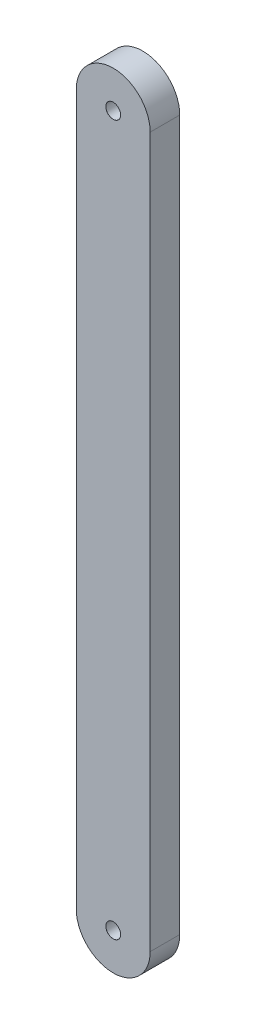
ISO-10303-21;
HEADER;
FILE_DESCRIPTION(('STEP AP214'),'2;1');
FILE_NAME('part.step','',(''),(''),'','','');
FILE_SCHEMA(('AUTOMOTIVE_DESIGN { 1 0 10303 214 1 1 1 1 }'));
ENDSEC;
DATA;
#1=APPLICATION_CONTEXT('core data for automotive mechanical design processes');
#2=APPLICATION_PROTOCOL_DEFINITION('international standard','automotive_design',2000,#1);
#3=PRODUCT_CONTEXT('',#1,'mechanical');
#4=PRODUCT('Part','Part','',(#3));
#5=PRODUCT_RELATED_PRODUCT_CATEGORY('part','',(#4));
#6=PRODUCT_DEFINITION_FORMATION('','',#4);
#7=PRODUCT_DEFINITION_CONTEXT('part definition',#1,'design');
#8=PRODUCT_DEFINITION('design','',#6,#7);
#9=PRODUCT_DEFINITION_SHAPE('','',#8);
#10=(LENGTH_UNIT() NAMED_UNIT(*) SI_UNIT(.MILLI.,.METRE.));
#11=(NAMED_UNIT(*) PLANE_ANGLE_UNIT() SI_UNIT($,.RADIAN.));
#12=(NAMED_UNIT(*) SI_UNIT($,.STERADIAN.) SOLID_ANGLE_UNIT());
#13=UNCERTAINTY_MEASURE_WITH_UNIT(LENGTH_MEASURE(1.E-05),#10,'distance_accuracy_value','');
#14=(GEOMETRIC_REPRESENTATION_CONTEXT(3) GLOBAL_UNCERTAINTY_ASSIGNED_CONTEXT((#13)) GLOBAL_UNIT_ASSIGNED_CONTEXT((#10,
#11,#12)) REPRESENTATION_CONTEXT('',''));
#15=CARTESIAN_POINT('',(0.,0.,0.));
#16=DIRECTION('',(0.,0.,1.));
#17=DIRECTION('',(1.,0.,0.));
#18=AXIS2_PLACEMENT_3D('',#15,#16,#17);
#19=CARTESIAN_POINT('',(-25.,-240.,20.));
#20=DIRECTION('',(0.,0.,-1.));
#21=DIRECTION('',(-1.,0.,0.));
#22=AXIS2_PLACEMENT_3D('',#19,#20,#21);
#23=CYLINDRICAL_SURFACE('',#22,25.);
#24=CARTESIAN_POINT('',(-25.,-240.,0.));
#25=DIRECTION('',(0.,0.,1.));
#26=DIRECTION('',(-1.,0.,0.));
#27=AXIS2_PLACEMENT_3D('',#24,#25,#26);
#28=CIRCLE('',#27,25.);
#29=CARTESIAN_POINT('',(-50.,-240.,0.));
#30=VERTEX_POINT('',#29);
#31=CARTESIAN_POINT('',(0.,-240.,0.));
#32=VERTEX_POINT('',#31);
#33=EDGE_CURVE('E96',#30,#32,#28,.T.);
#34=ORIENTED_EDGE('',*,*,#33,.T.);
#35=DIRECTION('',(0.,0.,-1.));
#36=VECTOR('',#35,1.);
#37=CARTESIAN_POINT('',(0.,-240.,20.));
#38=LINE('',#37,#36);
#39=CARTESIAN_POINT('',(0.,-240.,20.));
#40=VERTEX_POINT('',#39);
#41=EDGE_CURVE('E11',#40,#32,#38,.T.);
#42=ORIENTED_EDGE('',*,*,#41,.F.);
#43=CARTESIAN_POINT('',(-25.,-240.,20.));
#44=DIRECTION('',(0.,0.,1.));
#45=DIRECTION('',(-1.,0.,0.));
#46=AXIS2_PLACEMENT_3D('',#43,#44,#45);
#47=CIRCLE('',#46,25.);
#48=CARTESIAN_POINT('',(-50.,-240.,20.));
#49=VERTEX_POINT('',#48);
#50=EDGE_CURVE('E84',#49,#40,#47,.T.);
#51=ORIENTED_EDGE('',*,*,#50,.F.);
#52=DIRECTION('',(0.,0.,-1.));
#53=VECTOR('',#52,1.);
#54=CARTESIAN_POINT('',(-50.,-240.,20.));
#55=LINE('',#54,#53);
#56=EDGE_CURVE('E92',#49,#30,#55,.T.);
#57=ORIENTED_EDGE('',*,*,#56,.T.);
#58=EDGE_LOOP('',(#34,#42,#51,#57));
#59=FACE_BOUND('',#58,.T.);
#60=ADVANCED_FACE('F33',(#59),#23,.T.);
#61=CARTESIAN_POINT('',(0.,240.,20.));
#62=DIRECTION('',(-1.,0.,0.));
#63=DIRECTION('',(0.,-1.,0.));
#64=AXIS2_PLACEMENT_3D('',#61,#62,#63);
#65=PLANE('',#64);
#66=DIRECTION('',(0.,1.,0.));
#67=VECTOR('',#66,1.);
#68=CARTESIAN_POINT('',(0.,240.,0.));
#69=LINE('',#68,#67);
#70=CARTESIAN_POINT('',(0.,240.,0.));
#71=VERTEX_POINT('',#70);
#72=EDGE_CURVE('E88',#32,#71,#69,.T.);
#73=ORIENTED_EDGE('',*,*,#72,.T.);
#74=DIRECTION('',(0.,0.,-1.));
#75=VECTOR('',#74,1.);
#76=CARTESIAN_POINT('',(0.,240.,20.));
#77=LINE('',#76,#75);
#78=CARTESIAN_POINT('',(0.,240.,20.));
#79=VERTEX_POINT('',#78);
#80=EDGE_CURVE('E41',#79,#71,#77,.T.);
#81=ORIENTED_EDGE('',*,*,#80,.F.);
#82=DIRECTION('',(0.,1.,0.));
#83=VECTOR('',#82,1.);
#84=CARTESIAN_POINT('',(0.,240.,20.));
#85=LINE('',#84,#83);
#86=EDGE_CURVE('E79',#40,#79,#85,.T.);
#87=ORIENTED_EDGE('',*,*,#86,.F.);
#88=ORIENTED_EDGE('',*,*,#41,.T.);
#89=EDGE_LOOP('',(#73,#81,#87,#88));
#90=FACE_BOUND('',#89,.T.);
#91=ADVANCED_FACE('F87',(#90),#65,.F.);
#92=CARTESIAN_POINT('',(-25.,240.,20.));
#93=DIRECTION('',(0.,0.,-1.));
#94=DIRECTION('',(-1.,0.,0.));
#95=AXIS2_PLACEMENT_3D('',#92,#93,#94);
#96=CYLINDRICAL_SURFACE('',#95,25.);
#97=CARTESIAN_POINT('',(-25.,240.,0.));
#98=DIRECTION('',(0.,0.,1.));
#99=DIRECTION('',(-1.,0.,0.));
#100=AXIS2_PLACEMENT_3D('',#97,#98,#99);
#101=CIRCLE('',#100,25.);
#102=CARTESIAN_POINT('',(-50.,240.,0.));
#103=VERTEX_POINT('',#102);
#104=EDGE_CURVE('E66',#71,#103,#101,.T.);
#105=ORIENTED_EDGE('',*,*,#104,.T.);
#106=DIRECTION('',(0.,0.,-1.));
#107=VECTOR('',#106,1.);
#108=CARTESIAN_POINT('',(-50.,240.,20.));
#109=LINE('',#108,#107);
#110=CARTESIAN_POINT('',(-50.,240.,20.));
#111=VERTEX_POINT('',#110);
#112=EDGE_CURVE('E89',#111,#103,#109,.T.);
#113=ORIENTED_EDGE('',*,*,#112,.F.);
#114=CARTESIAN_POINT('',(-25.,240.,20.));
#115=DIRECTION('',(0.,0.,1.));
#116=DIRECTION('',(-1.,0.,0.));
#117=AXIS2_PLACEMENT_3D('',#114,#115,#116);
#118=CIRCLE('',#117,25.);
#119=EDGE_CURVE('E82',#79,#111,#118,.T.);
#120=ORIENTED_EDGE('',*,*,#119,.F.);
#121=ORIENTED_EDGE('',*,*,#80,.T.);
#122=EDGE_LOOP('',(#105,#113,#120,#121));
#123=FACE_BOUND('',#122,.T.);
#124=ADVANCED_FACE('F90',(#123),#96,.T.);
#125=CARTESIAN_POINT('',(-50.,-240.,20.));
#126=DIRECTION('',(1.,0.,0.));
#127=DIRECTION('',(0.,0.,-1.));
#128=AXIS2_PLACEMENT_3D('',#125,#126,#127);
#129=PLANE('',#128);
#130=DIRECTION('',(0.,-1.,0.));
#131=VECTOR('',#130,1.);
#132=CARTESIAN_POINT('',(-50.,-240.,0.));
#133=LINE('',#132,#131);
#134=EDGE_CURVE('E72',#103,#30,#133,.T.);
#135=ORIENTED_EDGE('',*,*,#134,.T.);
#136=ORIENTED_EDGE('',*,*,#56,.F.);
#137=DIRECTION('',(0.,-1.,0.));
#138=VECTOR('',#137,1.);
#139=CARTESIAN_POINT('',(-50.,-240.,20.));
#140=LINE('',#139,#138);
#141=EDGE_CURVE('E49',#111,#49,#140,.T.);
#142=ORIENTED_EDGE('',*,*,#141,.F.);
#143=ORIENTED_EDGE('',*,*,#112,.T.);
#144=EDGE_LOOP('',(#135,#136,#142,#143));
#145=FACE_BOUND('',#144,.T.);
#146=ADVANCED_FACE('F104',(#145),#129,.F.);
#147=CARTESIAN_POINT('',(-25.,-240.,20.));
#148=DIRECTION('',(0.,0.,-1.));
#149=DIRECTION('',(-1.,0.,0.));
#150=AXIS2_PLACEMENT_3D('',#147,#148,#149);
#151=PLANE('',#150);
#152=CARTESIAN_POINT('',(-25.,240.,20.));
#153=DIRECTION('',(0.,0.,1.));
#154=DIRECTION('',(1.,0.,0.));
#155=AXIS2_PLACEMENT_3D('',#152,#153,#154);
#156=CIRCLE('',#155,5.025);
#157=CARTESIAN_POINT('',(-19.975,240.,20.));
#158=VERTEX_POINT('',#157);
#159=EDGE_CURVE('E124',#158,#158,#156,.T.);
#160=ORIENTED_EDGE('',*,*,#159,.F.);
#161=EDGE_LOOP('',(#160));
#162=FACE_BOUND('',#161,.T.);
#163=CARTESIAN_POINT('',(-25.,-240.,20.));
#164=DIRECTION('',(0.,0.,1.));
#165=DIRECTION('',(1.,0.,0.));
#166=AXIS2_PLACEMENT_3D('',#163,#164,#165);
#167=CIRCLE('',#166,5.025);
#168=CARTESIAN_POINT('',(-19.975,-240.,20.));
#169=VERTEX_POINT('',#168);
#170=EDGE_CURVE('E115',#169,#169,#167,.T.);
#171=ORIENTED_EDGE('',*,*,#170,.F.);
#172=EDGE_LOOP('',(#171));
#173=FACE_BOUND('',#172,.T.);
#174=ORIENTED_EDGE('',*,*,#50,.T.);
#175=ORIENTED_EDGE('',*,*,#86,.T.);
#176=ORIENTED_EDGE('',*,*,#119,.T.);
#177=ORIENTED_EDGE('',*,*,#141,.T.);
#178=EDGE_LOOP('',(#174,#175,#176,#177));
#179=FACE_BOUND('',#178,.T.);
#180=ADVANCED_FACE('F80',(#162,#173,#179),#151,.F.);
#181=CARTESIAN_POINT('',(-25.,-240.,0.));
#182=DIRECTION('',(0.,0.,-1.));
#183=DIRECTION('',(-1.,0.,0.));
#184=AXIS2_PLACEMENT_3D('',#181,#182,#183);
#185=PLANE('',#184);
#186=CARTESIAN_POINT('',(-25.,240.,0.));
#187=DIRECTION('',(0.,0.,1.));
#188=DIRECTION('',(1.,0.,0.));
#189=AXIS2_PLACEMENT_3D('',#186,#187,#188);
#190=CIRCLE('',#189,5.);
#191=CARTESIAN_POINT('',(-20.,240.,0.));
#192=VERTEX_POINT('',#191);
#193=EDGE_CURVE('E118',#192,#192,#190,.T.);
#194=ORIENTED_EDGE('',*,*,#193,.T.);
#195=EDGE_LOOP('',(#194));
#196=FACE_BOUND('',#195,.T.);
#197=CARTESIAN_POINT('',(-25.,-240.,0.));
#198=DIRECTION('',(0.,0.,1.));
#199=DIRECTION('',(1.,0.,0.));
#200=AXIS2_PLACEMENT_3D('',#197,#198,#199);
#201=CIRCLE('',#200,5.);
#202=CARTESIAN_POINT('',(-20.,-240.,0.));
#203=VERTEX_POINT('',#202);
#204=EDGE_CURVE('E99',#203,#203,#201,.T.);
#205=ORIENTED_EDGE('',*,*,#204,.T.);
#206=EDGE_LOOP('',(#205));
#207=FACE_BOUND('',#206,.T.);
#208=ORIENTED_EDGE('',*,*,#33,.F.);
#209=ORIENTED_EDGE('',*,*,#134,.F.);
#210=ORIENTED_EDGE('',*,*,#104,.F.);
#211=ORIENTED_EDGE('',*,*,#72,.F.);
#212=EDGE_LOOP('',(#208,#209,#210,#211));
#213=FACE_BOUND('',#212,.T.);
#214=ADVANCED_FACE('F107',(#196,#207,#213),#185,.T.);
#215=CARTESIAN_POINT('',(-25.,-240.,20.));
#216=DIRECTION('',(0.,0.,1.));
#217=DIRECTION('',(1.,0.,0.));
#218=AXIS2_PLACEMENT_3D('',#215,#216,#217);
#219=CYLINDRICAL_SURFACE('',#218,5.);
#220=ORIENTED_EDGE('',*,*,#204,.F.);
#221=EDGE_LOOP('',(#220));
#222=FACE_BOUND('',#221,.T.);
#223=CARTESIAN_POINT('',(-25.,-240.,19.975));
#224=DIRECTION('',(0.,0.,1.));
#225=DIRECTION('',(1.,0.,0.));
#226=AXIS2_PLACEMENT_3D('',#223,#224,#225);
#227=CIRCLE('',#226,5.);
#228=CARTESIAN_POINT('',(-20.,-240.,19.975));
#229=VERTEX_POINT('',#228);
#230=EDGE_CURVE('E112',#229,#229,#227,.T.);
#231=ORIENTED_EDGE('',*,*,#230,.T.);
#232=EDGE_LOOP('',(#231));
#233=FACE_BOUND('',#232,.T.);
#234=ADVANCED_FACE('F138',(#222,#233),#219,.F.);
#235=CARTESIAN_POINT('',(-25.,-240.,20.));
#236=DIRECTION('',(0.,0.,1.));
#237=DIRECTION('',(1.,0.,0.));
#238=AXIS2_PLACEMENT_3D('',#235,#236,#237);
#239=CONICAL_SURFACE('',#238,5.025,0.785398163397587);
#240=ORIENTED_EDGE('',*,*,#230,.F.);
#241=EDGE_LOOP('',(#240));
#242=FACE_BOUND('',#241,.T.);
#243=ORIENTED_EDGE('',*,*,#170,.T.);
#244=EDGE_LOOP('',(#243));
#245=FACE_BOUND('',#244,.T.);
#246=ADVANCED_FACE('F135',(#242,#245),#239,.F.);
#247=CARTESIAN_POINT('',(-25.,240.,20.));
#248=DIRECTION('',(0.,0.,1.));
#249=DIRECTION('',(1.,0.,0.));
#250=AXIS2_PLACEMENT_3D('',#247,#248,#249);
#251=CYLINDRICAL_SURFACE('',#250,5.);
#252=ORIENTED_EDGE('',*,*,#193,.F.);
#253=EDGE_LOOP('',(#252));
#254=FACE_BOUND('',#253,.T.);
#255=CARTESIAN_POINT('',(-25.,240.,19.975));
#256=DIRECTION('',(0.,0.,1.));
#257=DIRECTION('',(1.,0.,0.));
#258=AXIS2_PLACEMENT_3D('',#255,#256,#257);
#259=CIRCLE('',#258,5.);
#260=CARTESIAN_POINT('',(-20.,240.,19.975));
#261=VERTEX_POINT('',#260);
#262=EDGE_CURVE('E121',#261,#261,#259,.T.);
#263=ORIENTED_EDGE('',*,*,#262,.T.);
#264=EDGE_LOOP('',(#263));
#265=FACE_BOUND('',#264,.T.);
#266=ADVANCED_FACE('F137',(#254,#265),#251,.F.);
#267=CARTESIAN_POINT('',(-25.,240.,20.));
#268=DIRECTION('',(0.,0.,1.));
#269=DIRECTION('',(1.,0.,0.));
#270=AXIS2_PLACEMENT_3D('',#267,#268,#269);
#271=CONICAL_SURFACE('',#270,5.025,0.785398163397587);
#272=ORIENTED_EDGE('',*,*,#262,.F.);
#273=EDGE_LOOP('',(#272));
#274=FACE_BOUND('',#273,.T.);
#275=ORIENTED_EDGE('',*,*,#159,.T.);
#276=EDGE_LOOP('',(#275));
#277=FACE_BOUND('',#276,.T.);
#278=ADVANCED_FACE('F128',(#274,#277),#271,.F.);
#279=CLOSED_SHELL('',(#60,#91,#124,#146,#180,#214,#234,#246,#266,#278));
#280=MANIFOLD_SOLID_BREP('B2',#279);
#281=ADVANCED_BREP_SHAPE_REPRESENTATION('',(#18,#280),#14);
#282=SHAPE_DEFINITION_REPRESENTATION(#9,#281);
ENDSEC;
END-ISO-10303-21;
